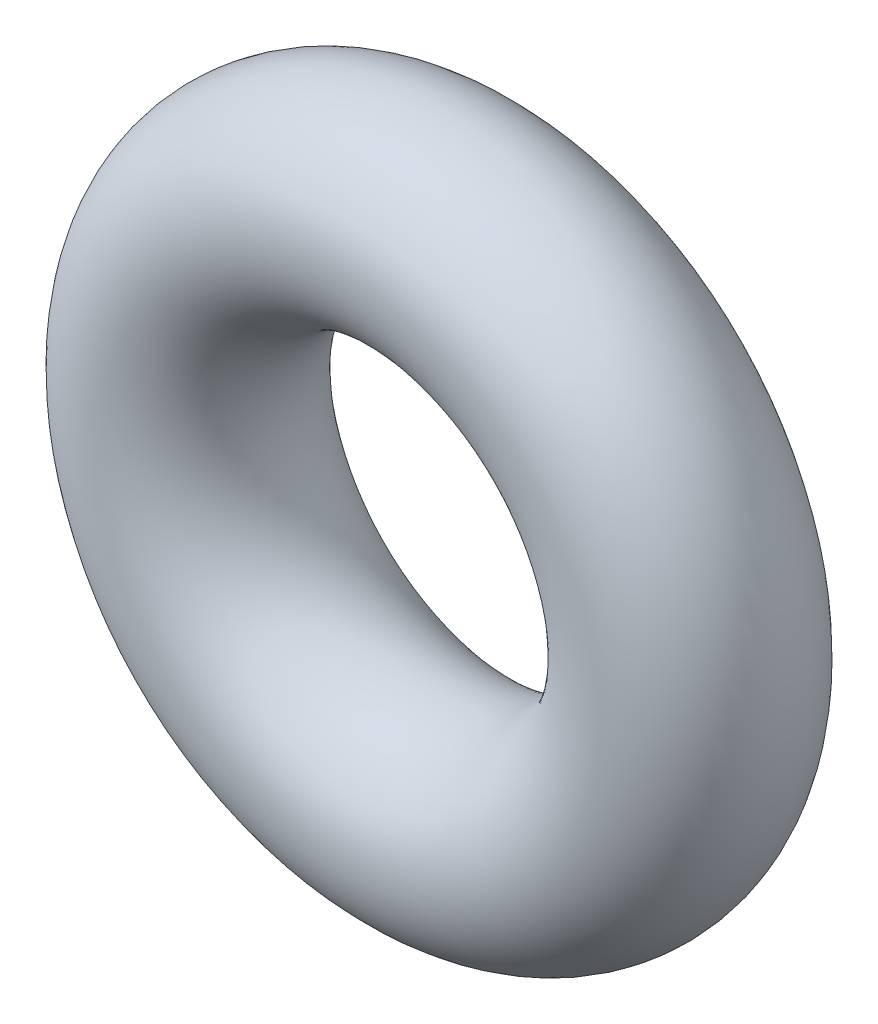
ISO-10303-21;
HEADER;
FILE_DESCRIPTION(('STEP AP214'),'2;1');
FILE_NAME('part.step','',(''),(''),'','','');
FILE_SCHEMA(('AUTOMOTIVE_DESIGN { 1 0 10303 214 1 1 1 1 }'));
ENDSEC;
DATA;
#1=APPLICATION_CONTEXT('core data for automotive mechanical design processes');
#2=APPLICATION_PROTOCOL_DEFINITION('international standard','automotive_design',2000,#1);
#3=PRODUCT_CONTEXT('',#1,'mechanical');
#4=PRODUCT('Part','Part','',(#3));
#5=PRODUCT_RELATED_PRODUCT_CATEGORY('part','',(#4));
#6=PRODUCT_DEFINITION_FORMATION('','',#4);
#7=PRODUCT_DEFINITION_CONTEXT('part definition',#1,'design');
#8=PRODUCT_DEFINITION('design','',#6,#7);
#9=PRODUCT_DEFINITION_SHAPE('','',#8);
#10=(LENGTH_UNIT() NAMED_UNIT(*) SI_UNIT(.MILLI.,.METRE.));
#11=(NAMED_UNIT(*) PLANE_ANGLE_UNIT() SI_UNIT($,.RADIAN.));
#12=(NAMED_UNIT(*) SI_UNIT($,.STERADIAN.) SOLID_ANGLE_UNIT());
#13=UNCERTAINTY_MEASURE_WITH_UNIT(LENGTH_MEASURE(1.E-05),#10,'distance_accuracy_value','');
#14=(GEOMETRIC_REPRESENTATION_CONTEXT(3) GLOBAL_UNCERTAINTY_ASSIGNED_CONTEXT((#13)) GLOBAL_UNIT_ASSIGNED_CONTEXT((#10,
#11,#12)) REPRESENTATION_CONTEXT('',''));
#15=CARTESIAN_POINT('',(0.,0.,0.));
#16=DIRECTION('',(0.,0.,1.));
#17=DIRECTION('',(1.,0.,0.));
#18=AXIS2_PLACEMENT_3D('',#15,#16,#17);
#19=CARTESIAN_POINT('',(0.,0.,0.));
#20=DIRECTION('',(0.,0.,1.));
#21=DIRECTION('',(1.,0.,0.));
#22=AXIS2_PLACEMENT_3D('',#19,#20,#21);
#23=TOROIDAL_SURFACE('',#22,2.5,1.);
#24=CARTESIAN_POINT('',(3.5,0.,0.));
#25=VERTEX_POINT('',#24);
#26=VERTEX_LOOP('',#25);
#27=FACE_BOUND('',#26,.T.);
#28=ADVANCED_FACE('F28',(#27),#23,.T.);
#29=CLOSED_SHELL('',(#28));
#30=MANIFOLD_SOLID_BREP('B2',#29);
#31=ADVANCED_BREP_SHAPE_REPRESENTATION('',(#18,#30),#14);
#32=SHAPE_DEFINITION_REPRESENTATION(#9,#31);
ENDSEC;
END-ISO-10303-21;
